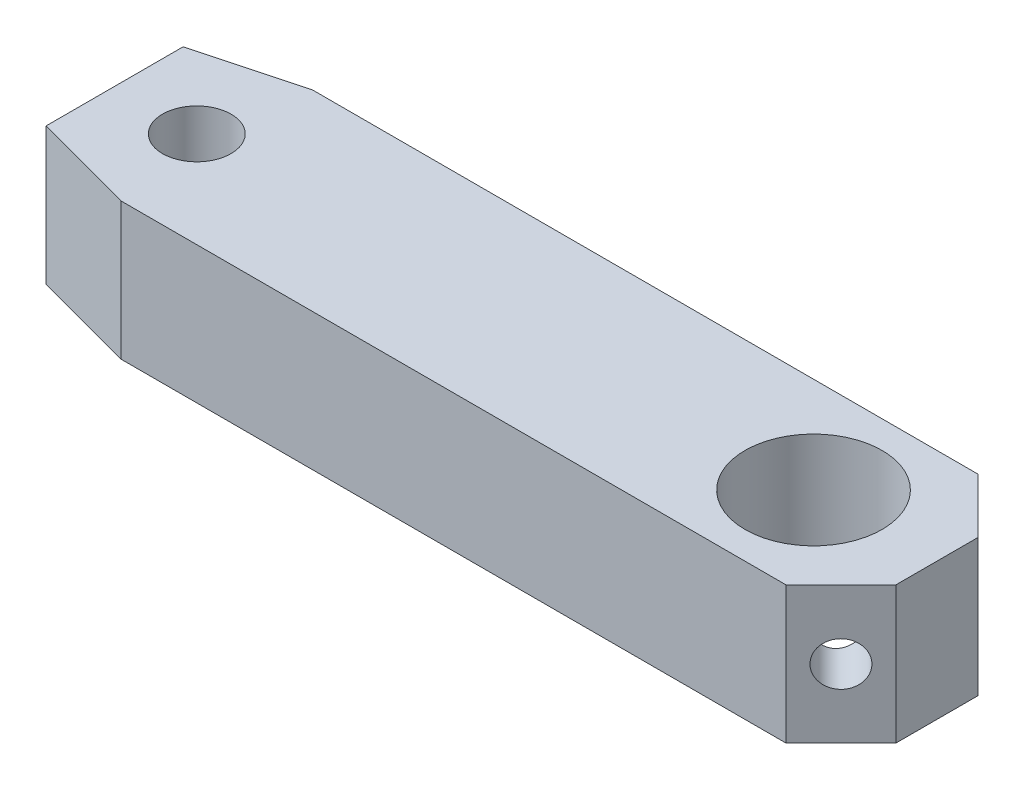
ISO-10303-21;
HEADER;
FILE_DESCRIPTION(('STEP AP214'),'2;1');
FILE_NAME('part.step','',(''),(''),'','','');
FILE_SCHEMA(('AUTOMOTIVE_DESIGN { 1 0 10303 214 1 1 1 1 }'));
ENDSEC;
DATA;
#1=APPLICATION_CONTEXT('core data for automotive mechanical design processes');
#2=APPLICATION_PROTOCOL_DEFINITION('international standard','automotive_design',2000,#1);
#3=PRODUCT_CONTEXT('',#1,'mechanical');
#4=PRODUCT('Part','Part','',(#3));
#5=PRODUCT_RELATED_PRODUCT_CATEGORY('part','',(#4));
#6=PRODUCT_DEFINITION_FORMATION('','',#4);
#7=PRODUCT_DEFINITION_CONTEXT('part definition',#1,'design');
#8=PRODUCT_DEFINITION('design','',#6,#7);
#9=PRODUCT_DEFINITION_SHAPE('','',#8);
#10=(LENGTH_UNIT() NAMED_UNIT(*) SI_UNIT(.MILLI.,.METRE.));
#11=(NAMED_UNIT(*) PLANE_ANGLE_UNIT() SI_UNIT($,.RADIAN.));
#12=(NAMED_UNIT(*) SI_UNIT($,.STERADIAN.) SOLID_ANGLE_UNIT());
#13=UNCERTAINTY_MEASURE_WITH_UNIT(LENGTH_MEASURE(1.E-05),#10,'distance_accuracy_value','');
#14=(GEOMETRIC_REPRESENTATION_CONTEXT(3) GLOBAL_UNCERTAINTY_ASSIGNED_CONTEXT((#13)) GLOBAL_UNIT_ASSIGNED_CONTEXT((#10,
#11,#12)) REPRESENTATION_CONTEXT('',''));
#15=CARTESIAN_POINT('',(0.,0.,0.));
#16=DIRECTION('',(0.,0.,1.));
#17=DIRECTION('',(1.,0.,0.));
#18=AXIS2_PLACEMENT_3D('',#15,#16,#17);
#19=CARTESIAN_POINT('',(0.,-5.,3.5));
#20=DIRECTION('',(0.,0.,1.));
#21=DIRECTION('',(1.,0.,0.));
#22=AXIS2_PLACEMENT_3D('',#19,#20,#21);
#23=PLANE('',#22);
#24=DIRECTION('',(1.,0.,0.));
#25=VECTOR('',#24,1.);
#26=CARTESIAN_POINT('',(0.,0.,3.5));
#27=LINE('',#26,#25);
#28=CARTESIAN_POINT('',(0.732050807568831,0.,3.5));
#29=VERTEX_POINT('',#28);
#30=CARTESIAN_POINT('',(25.,0.,3.5));
#31=VERTEX_POINT('',#30);
#32=EDGE_CURVE('E143',#29,#31,#27,.T.);
#33=ORIENTED_EDGE('',*,*,#32,.F.);
#34=DIRECTION('',(0.,1.,0.));
#35=VECTOR('',#34,1.);
#36=CARTESIAN_POINT('',(0.732050807568831,-5.,3.5));
#37=LINE('',#36,#35);
#38=CARTESIAN_POINT('',(0.732050807568831,-5.,3.5));
#39=VERTEX_POINT('',#38);
#40=EDGE_CURVE('E11',#39,#29,#37,.T.);
#41=ORIENTED_EDGE('',*,*,#40,.F.);
#42=DIRECTION('',(1.,0.,0.));
#43=VECTOR('',#42,1.);
#44=CARTESIAN_POINT('',(0.,-5.,3.5));
#45=LINE('',#44,#43);
#46=CARTESIAN_POINT('',(25.,-5.,3.5));
#47=VERTEX_POINT('',#46);
#48=EDGE_CURVE('E175',#39,#47,#45,.T.);
#49=ORIENTED_EDGE('',*,*,#48,.T.);
#50=DIRECTION('',(0.,1.,0.));
#51=VECTOR('',#50,1.);
#52=CARTESIAN_POINT('',(25.,-5.,3.5));
#53=LINE('',#52,#51);
#54=EDGE_CURVE('E46',#47,#31,#53,.T.);
#55=ORIENTED_EDGE('',*,*,#54,.T.);
#56=EDGE_LOOP('',(#33,#41,#49,#55));
#57=FACE_BOUND('',#56,.T.);
#58=ADVANCED_FACE('F42',(#57),#23,.T.);
#59=CARTESIAN_POINT('',(-0.825961894323354,-5.,3.08253175473055));
#60=DIRECTION('',(-0.258819045102524,0.,0.965925826289068));
#61=DIRECTION('',(0.965925826289068,0.,0.258819045102524));
#62=AXIS2_PLACEMENT_3D('',#59,#60,#61);
#63=PLANE('',#62);
#64=DIRECTION('',(0.965925826289068,0.,0.258819045102524));
#65=VECTOR('',#64,1.);
#66=CARTESIAN_POINT('',(-0.825961894323354,0.,3.08253175473055));
#67=LINE('',#66,#65);
#68=CARTESIAN_POINT('',(-3.,0.,2.5));
#69=VERTEX_POINT('',#68);
#70=EDGE_CURVE('E162',#69,#29,#67,.T.);
#71=ORIENTED_EDGE('',*,*,#70,.F.);
#72=DIRECTION('',(0.,1.,0.));
#73=VECTOR('',#72,1.);
#74=CARTESIAN_POINT('',(-3.,-5.,2.5));
#75=LINE('',#74,#73);
#76=CARTESIAN_POINT('',(-3.,-5.,2.5));
#77=VERTEX_POINT('',#76);
#78=EDGE_CURVE('E52',#77,#69,#75,.T.);
#79=ORIENTED_EDGE('',*,*,#78,.F.);
#80=DIRECTION('',(0.965925826289068,0.,0.258819045102524));
#81=VECTOR('',#80,1.);
#82=CARTESIAN_POINT('',(-0.825961894323354,-5.,3.08253175473055));
#83=LINE('',#82,#81);
#84=EDGE_CURVE('E129',#77,#39,#83,.T.);
#85=ORIENTED_EDGE('',*,*,#84,.T.);
#86=ORIENTED_EDGE('',*,*,#40,.T.);
#87=EDGE_LOOP('',(#71,#79,#85,#86));
#88=FACE_BOUND('',#87,.T.);
#89=ADVANCED_FACE('F179',(#88),#63,.T.);
#90=CARTESIAN_POINT('',(-3.,-5.,0.));
#91=DIRECTION('',(-1.,0.,0.));
#92=DIRECTION('',(0.,0.,1.));
#93=AXIS2_PLACEMENT_3D('',#90,#91,#92);
#94=PLANE('',#93);
#95=DIRECTION('',(0.,0.,1.));
#96=VECTOR('',#95,1.);
#97=CARTESIAN_POINT('',(-3.,0.,0.));
#98=LINE('',#97,#96);
#99=CARTESIAN_POINT('',(-3.,0.,-2.5));
#100=VERTEX_POINT('',#99);
#101=EDGE_CURVE('E117',#100,#69,#98,.T.);
#102=ORIENTED_EDGE('',*,*,#101,.F.);
#103=DIRECTION('',(0.,1.,0.));
#104=VECTOR('',#103,1.);
#105=CARTESIAN_POINT('',(-3.,-5.,-2.5));
#106=LINE('',#105,#104);
#107=CARTESIAN_POINT('',(-3.,-5.,-2.5));
#108=VERTEX_POINT('',#107);
#109=EDGE_CURVE('E112',#108,#100,#106,.T.);
#110=ORIENTED_EDGE('',*,*,#109,.F.);
#111=DIRECTION('',(0.,0.,1.));
#112=VECTOR('',#111,1.);
#113=CARTESIAN_POINT('',(-3.,-5.,0.));
#114=LINE('',#113,#112);
#115=EDGE_CURVE('E115',#108,#77,#114,.T.);
#116=ORIENTED_EDGE('',*,*,#115,.T.);
#117=ORIENTED_EDGE('',*,*,#78,.T.);
#118=EDGE_LOOP('',(#102,#110,#116,#117));
#119=FACE_BOUND('',#118,.T.);
#120=ADVANCED_FACE('F114',(#119),#94,.T.);
#121=CARTESIAN_POINT('',(-0.825961894323355,-5.,-3.08253175473055));
#122=DIRECTION('',(-0.258819045102524,0.,-0.965925826289068));
#123=DIRECTION('',(-0.965925826289068,0.,0.258819045102524));
#124=AXIS2_PLACEMENT_3D('',#121,#122,#123);
#125=PLANE('',#124);
#126=DIRECTION('',(-0.965925826289067,0.,0.258819045102524));
#127=VECTOR('',#126,1.);
#128=CARTESIAN_POINT('',(-0.825961894323355,0.,-3.08253175473055));
#129=LINE('',#128,#127);
#130=CARTESIAN_POINT('',(0.732050807568824,0.,-3.5));
#131=VERTEX_POINT('',#130);
#132=EDGE_CURVE('E159',#131,#100,#129,.T.);
#133=ORIENTED_EDGE('',*,*,#132,.F.);
#134=DIRECTION('',(0.,1.,0.));
#135=VECTOR('',#134,1.);
#136=CARTESIAN_POINT('',(0.732050807568824,-5.,-3.5));
#137=LINE('',#136,#135);
#138=CARTESIAN_POINT('',(0.732050807568824,-5.,-3.5));
#139=VERTEX_POINT('',#138);
#140=EDGE_CURVE('E122',#139,#131,#137,.T.);
#141=ORIENTED_EDGE('',*,*,#140,.F.);
#142=DIRECTION('',(-0.965925826289067,0.,0.258819045102524));
#143=VECTOR('',#142,1.);
#144=CARTESIAN_POINT('',(-0.825961894323355,-5.,-3.08253175473055));
#145=LINE('',#144,#143);
#146=EDGE_CURVE('E128',#139,#108,#145,.T.);
#147=ORIENTED_EDGE('',*,*,#146,.T.);
#148=ORIENTED_EDGE('',*,*,#109,.T.);
#149=EDGE_LOOP('',(#133,#141,#147,#148));
#150=FACE_BOUND('',#149,.T.);
#151=ADVANCED_FACE('F131',(#150),#125,.T.);
#152=CARTESIAN_POINT('',(0.,-5.,-3.5));
#153=DIRECTION('',(0.,0.,1.));
#154=DIRECTION('',(1.,0.,0.));
#155=AXIS2_PLACEMENT_3D('',#152,#153,#154);
#156=PLANE('',#155);
#157=DIRECTION('',(1.,0.,0.));
#158=VECTOR('',#157,1.);
#159=CARTESIAN_POINT('',(0.,0.,-3.5));
#160=LINE('',#159,#158);
#161=CARTESIAN_POINT('',(25.,0.,-3.5));
#162=VERTEX_POINT('',#161);
#163=EDGE_CURVE('E156',#131,#162,#160,.T.);
#164=ORIENTED_EDGE('',*,*,#163,.T.);
#165=DIRECTION('',(0.,1.,0.));
#166=VECTOR('',#165,1.);
#167=CARTESIAN_POINT('',(25.,-5.,-3.5));
#168=LINE('',#167,#166);
#169=CARTESIAN_POINT('',(25.,-5.,-3.5));
#170=VERTEX_POINT('',#169);
#171=EDGE_CURVE('E168',#170,#162,#168,.T.);
#172=ORIENTED_EDGE('',*,*,#171,.F.);
#173=DIRECTION('',(1.,0.,0.));
#174=VECTOR('',#173,1.);
#175=CARTESIAN_POINT('',(0.,-5.,-3.5));
#176=LINE('',#175,#174);
#177=EDGE_CURVE('E133',#139,#170,#176,.T.);
#178=ORIENTED_EDGE('',*,*,#177,.F.);
#179=ORIENTED_EDGE('',*,*,#140,.T.);
#180=EDGE_LOOP('',(#164,#172,#178,#179));
#181=FACE_BOUND('',#180,.T.);
#182=ADVANCED_FACE('F192',(#181),#156,.F.);
#183=CARTESIAN_POINT('',(14.25,-5.,-14.25));
#184=DIRECTION('',(-0.707106781186548,0.,0.707106781186547));
#185=DIRECTION('',(0.707106781186547,0.,0.707106781186548));
#186=AXIS2_PLACEMENT_3D('',#183,#184,#185);
#187=PLANE('',#186);
#188=CARTESIAN_POINT('',(26.,-2.5,-2.5));
#189=DIRECTION('',(0.707106781186549,0.,-0.707106781186546));
#190=DIRECTION('',(-0.707106781186546,0.,-0.707106781186549));
#191=AXIS2_PLACEMENT_3D('',#188,#189,#190);
#192=CIRCLE('',#191,0.799999999999998);
#193=CARTESIAN_POINT('',(25.4343145750508,-2.5,-3.06568542494924));
#194=VERTEX_POINT('',#193);
#195=EDGE_CURVE('E219',#194,#194,#192,.T.);
#196=ORIENTED_EDGE('',*,*,#195,.F.);
#197=EDGE_LOOP('',(#196));
#198=FACE_BOUND('',#197,.T.);
#199=DIRECTION('',(0.707106781186547,0.,0.707106781186548));
#200=VECTOR('',#199,1.);
#201=CARTESIAN_POINT('',(14.25,0.,-14.25));
#202=LINE('',#201,#200);
#203=CARTESIAN_POINT('',(27.,0.,-1.5));
#204=VERTEX_POINT('',#203);
#205=EDGE_CURVE('E153',#162,#204,#202,.T.);
#206=ORIENTED_EDGE('',*,*,#205,.T.);
#207=DIRECTION('',(0.,1.,0.));
#208=VECTOR('',#207,1.);
#209=CARTESIAN_POINT('',(27.,-5.,-1.5));
#210=LINE('',#209,#208);
#211=CARTESIAN_POINT('',(27.,-5.,-1.5));
#212=VERTEX_POINT('',#211);
#213=EDGE_CURVE('E171',#212,#204,#210,.T.);
#214=ORIENTED_EDGE('',*,*,#213,.F.);
#215=DIRECTION('',(0.707106781186547,0.,0.707106781186548));
#216=VECTOR('',#215,1.);
#217=CARTESIAN_POINT('',(14.25,-5.,-14.25));
#218=LINE('',#217,#216);
#219=EDGE_CURVE('E135',#170,#212,#218,.T.);
#220=ORIENTED_EDGE('',*,*,#219,.F.);
#221=ORIENTED_EDGE('',*,*,#171,.T.);
#222=EDGE_LOOP('',(#206,#214,#220,#221));
#223=FACE_BOUND('',#222,.T.);
#224=ADVANCED_FACE('F195',(#198,#223),#187,.F.);
#225=CARTESIAN_POINT('',(27.,-5.,0.));
#226=DIRECTION('',(-1.,0.,0.));
#227=DIRECTION('',(0.,0.,1.));
#228=AXIS2_PLACEMENT_3D('',#225,#226,#227);
#229=PLANE('',#228);
#230=DIRECTION('',(0.,0.,1.));
#231=VECTOR('',#230,1.);
#232=CARTESIAN_POINT('',(27.,0.,0.));
#233=LINE('',#232,#231);
#234=CARTESIAN_POINT('',(27.,0.,1.50000000000001));
#235=VERTEX_POINT('',#234);
#236=EDGE_CURVE('E150',#204,#235,#233,.T.);
#237=ORIENTED_EDGE('',*,*,#236,.T.);
#238=DIRECTION('',(0.,1.,0.));
#239=VECTOR('',#238,1.);
#240=CARTESIAN_POINT('',(27.,-5.,1.50000000000001));
#241=LINE('',#240,#239);
#242=CARTESIAN_POINT('',(27.,-5.,1.50000000000001));
#243=VERTEX_POINT('',#242);
#244=EDGE_CURVE('E173',#243,#235,#241,.T.);
#245=ORIENTED_EDGE('',*,*,#244,.F.);
#246=DIRECTION('',(0.,0.,1.));
#247=VECTOR('',#246,1.);
#248=CARTESIAN_POINT('',(27.,-5.,0.));
#249=LINE('',#248,#247);
#250=EDGE_CURVE('E274',#212,#243,#249,.T.);
#251=ORIENTED_EDGE('',*,*,#250,.F.);
#252=ORIENTED_EDGE('',*,*,#213,.T.);
#253=EDGE_LOOP('',(#237,#245,#251,#252));
#254=FACE_BOUND('',#253,.T.);
#255=ADVANCED_FACE('F199',(#254),#229,.F.);
#256=CARTESIAN_POINT('',(22.5,-5.,0.));
#257=DIRECTION('',(0.,1.,0.));
#258=DIRECTION('',(0.,0.,1.));
#259=AXIS2_PLACEMENT_3D('',#256,#257,#258);
#260=CYLINDRICAL_SURFACE('',#259,2.5);
#261=CARTESIAN_POINT('',(24.9761160595608,-2.5,0.344745209662324));
#262=CARTESIAN_POINT('',(24.9761161132327,-2.46056674168062,0.344744698496383));
#263=CARTESIAN_POINT('',(24.9756162079772,-2.42113468961461,0.348394094869442));
#264=CARTESIAN_POINT('',(24.9735673575216,-2.34357139868132,0.362648823498979));
#265=CARTESIAN_POINT('',(24.9720176498563,-2.30544112644636,0.373259211304448));
#266=CARTESIAN_POINT('',(24.9677505868392,-2.2317591660052,0.400491269083531));
#267=CARTESIAN_POINT('',(24.9650402937825,-2.19619337787686,0.417076486184014));
#268=CARTESIAN_POINT('',(24.9582779431126,-2.12801252759169,0.455240852150772));
#269=CARTESIAN_POINT('',(24.954225460699,-2.09539840379719,0.476821581434913));
#270=CARTESIAN_POINT('',(24.944087156873,-2.03029582870301,0.52644276801184));
#271=CARTESIAN_POINT('',(24.9378346664966,-1.99816762796562,0.554920009666209));
#272=CARTESIAN_POINT('',(24.9232087035849,-1.93826917730119,0.615659913443282));
#273=CARTESIAN_POINT('',(24.914834014564,-1.91050144171423,0.647924740970889));
#274=CARTESIAN_POINT('',(24.8940644901443,-1.85516103959588,0.721210602753545));
#275=CARTESIAN_POINT('',(24.8812227478646,-1.82847158901323,0.76277619707184));
#276=CARTESIAN_POINT('',(24.8520350256319,-1.78206825840768,0.848518577854122));
#277=CARTESIAN_POINT('',(24.8356873790795,-1.76235770779469,0.892696598926514));
#278=CARTESIAN_POINT('',(24.7986953460644,-1.72997450557127,0.984135869774383));
#279=CARTESIAN_POINT('',(24.7779063429172,-1.71761175489874,1.03144992309245));
#280=CARTESIAN_POINT('',(24.7327423537152,-1.70201456777326,1.12587442537223));
#281=CARTESIAN_POINT('',(24.7083698646201,-1.6987738065729,1.17298499278138));
#282=CARTESIAN_POINT('',(24.6589358209612,-1.70192578677669,1.26148814534927));
#283=CARTESIAN_POINT('',(24.6340967119677,-1.7075463773288,1.30303194308504));
#284=CARTESIAN_POINT('',(24.5830453640194,-1.72720966553188,1.38317592586862));
#285=CARTESIAN_POINT('',(24.5568338767105,-1.74124779607163,1.42177769438362));
#286=CARTESIAN_POINT('',(24.5065595247946,-1.77597710801097,1.49178495492437));
#287=CARTESIAN_POINT('',(24.4825013528259,-1.79600946708491,1.52352263174289));
#288=CARTESIAN_POINT('',(24.4354544195395,-1.84244032064919,1.58286153111332));
#289=CARTESIAN_POINT('',(24.412465555123,-1.86883819987569,1.61046315302071));
#290=CARTESIAN_POINT('',(24.3690812608835,-1.92672840221272,1.66060760856457));
#291=CARTESIAN_POINT('',(24.3486465635064,-1.9581203555707,1.68323263602939));
#292=CARTESIAN_POINT('',(24.3108775087112,-2.02546251293288,1.72380178799961));
#293=CARTESIAN_POINT('',(24.2935434025798,-2.06141308598629,1.74174553316549));
#294=CARTESIAN_POINT('',(24.2625316147044,-2.13761480075749,1.77312725582301));
#295=CARTESIAN_POINT('',(24.2489295329306,-2.17793458687524,1.78647330197107));
#296=CARTESIAN_POINT('',(24.2265263012616,-2.26117591642828,1.80813470822184));
#297=CARTESIAN_POINT('',(24.2177254043574,-2.30409759683393,1.81644980322894));
#298=CARTESIAN_POINT('',(24.2053166252262,-2.39186348402947,1.82810549207641));
#299=CARTESIAN_POINT('',(24.2017701510396,-2.43672421397746,1.83138727735636));
#300=CARTESIAN_POINT('',(24.2002593443137,-2.52662001615662,1.83279002684497));
#301=CARTESIAN_POINT('',(24.2022950756177,-2.57165509037588,1.83091093202898));
#302=CARTESIAN_POINT('',(24.2118368434312,-2.6606187377018,1.82199246655725));
#303=CARTESIAN_POINT('',(24.2193426077574,-2.70454736575156,1.81495335265862));
#304=CARTESIAN_POINT('',(24.2394187587553,-2.79005863081356,1.7957210735142));
#305=CARTESIAN_POINT('',(24.2519893736306,-2.83164116202303,1.78352767603408));
#306=CARTESIAN_POINT('',(24.2815378115837,-2.91130388691657,1.75401181197065));
#307=CARTESIAN_POINT('',(24.2985182817885,-2.94938195830203,1.736686263803));
#308=CARTESIAN_POINT('',(24.3359977542026,-3.02091139313654,1.69701337161271));
#309=CARTESIAN_POINT('',(24.356496518647,-3.05436306895999,1.67466636690667));
#310=CARTESIAN_POINT('',(24.3997715561237,-3.11539789199744,1.62540185576983));
#311=CARTESIAN_POINT('',(24.4225266418752,-3.14302920469224,1.59852546783562));
#312=CARTESIAN_POINT('',(24.4693252283709,-3.19199041793055,1.5405012959648));
#313=CARTESIAN_POINT('',(24.4933684573768,-3.21332164136421,1.50935441075957));
#314=CARTESIAN_POINT('',(24.5411107304113,-3.24877608075622,1.44411446660777));
#315=CARTESIAN_POINT('',(24.5648069449739,-3.26303590455338,1.41009343756235));
#316=CARTESIAN_POINT('',(24.6113453467195,-3.28474832348791,1.33940688742119));
#317=CARTESIAN_POINT('',(24.6341875325895,-3.29220090816009,1.30274136225999));
#318=CARTESIAN_POINT('',(24.6783579295829,-3.30037927287404,1.22746647973505));
#319=CARTESIAN_POINT('',(24.6996750466094,-3.30105992991869,1.18884580449425));
#320=CARTESIAN_POINT('',(24.7400598722893,-3.29587437805174,1.11088327763565));
#321=CARTESIAN_POINT('',(24.7591269679545,-3.29000638958123,1.07154123284769));
#322=CARTESIAN_POINT('',(24.7958540586701,-3.27157274732221,0.990534341936411));
#323=CARTESIAN_POINT('',(24.8133411589111,-3.25859520323939,0.948885363631738));
#324=CARTESIAN_POINT('',(24.8452896134877,-3.22627012291633,0.866922811663172));
#325=CARTESIAN_POINT('',(24.8597496768774,-3.20691987791406,0.826609813901095));
#326=CARTESIAN_POINT('',(24.8869699033778,-3.16022806752809,0.744589867127315));
#327=CARTESIAN_POINT('',(24.8994352525473,-3.13229923878663,0.703118300343519));
#328=CARTESIAN_POINT('',(24.9211250594103,-3.06992905260776,0.62435987055659));
#329=CARTESIAN_POINT('',(24.9303460650659,-3.03548081796418,0.587077493450344));
#330=CARTESIAN_POINT('',(24.946148957795,-2.95946649822726,0.517366838792101));
#331=CARTESIAN_POINT('',(24.9526461342799,-2.91772228773495,0.485111616216579));
#332=CARTESIAN_POINT('',(24.9630645359495,-2.82860677724593,0.429103117075196));
#333=CARTESIAN_POINT('',(24.9669921031293,-2.78124967448793,0.405328975066385));
#334=CARTESIAN_POINT('',(24.9720075866687,-2.69479840098415,0.373325606776821));
#335=CARTESIAN_POINT('',(24.9735611750963,-2.6566202388869,0.362690903771168));
#336=CARTESIAN_POINT('',(24.9756148222796,-2.57896002287273,0.348404688671673));
#337=CARTESIAN_POINT('',(24.9761160058261,-2.53947940689718,0.34474572142648));
#338=CARTESIAN_POINT('',(24.9761160595608,-2.5,0.344745209662324));
#339=B_SPLINE_CURVE_WITH_KNOTS('',3,(#261,#262,#263,#264,#265,#266,#267,#268,#269,#270,#271,
#272,#273,#274,#275,#276,#277,#278,#279,#280,#281,#282,#283,#284,#285,#286,#287,#288,#289,#290,
#291,#292,#293,#294,#295,#296,#297,#298,#299,#300,#301,#302,#303,#304,#305,#306,#307,#308,#309,
#310,#311,#312,#313,#314,#315,#316,#317,#318,#319,#320,#321,#322,#323,#324,#325,#326,#327,#328,
#329,#330,#331,#332,#333,#334,#335,#336,#337,#338),.UNSPECIFIED.,.T.,.F.,(4,2,2,2,2,2,2,2,2,2,2,
2,2,2,2,2,2,2,2,2,2,2,2,2,2,2,2,2,2,2,2,2,2,2,2,2,2,2,4),(0.,0.118135025892344,0.23635594465771,
0.3538674761644,0.471416235437724,0.601094876622618,0.730848020943202,0.88329083936668,
1.03580628570236,1.19436650179407,1.352816752769,1.49820453472615,1.64351350480901,
1.7766018016111,1.9096772398227,2.04035474791816,2.1710428419499,2.30421008102518,
2.43738433646307,2.57210303873622,2.70682328178433,2.84153682174975,2.97625643209217,
3.11105709895636,3.24584865962665,3.37947667728373,3.51307661580309,3.64398393798155,
3.77489146141141,3.90667067388502,4.03848570536667,4.1788983558552,4.31937076694053,
4.47327698869665,4.62734647760568,4.78590442380196,4.94406954545265,5.06246943242024,
5.18074271124086),.UNSPECIFIED.);
#340=CARTESIAN_POINT('',(24.9761160595608,-2.5,0.344745209662324));
#341=VERTEX_POINT('',#340);
#342=EDGE_CURVE('E216',#341,#341,#339,.T.);
#343=ORIENTED_EDGE('',*,*,#342,.T.);
#344=EDGE_LOOP('',(#343));
#345=FACE_BOUND('',#344,.T.);
#346=CARTESIAN_POINT('',(24.2008607603936,-2.5,-1.83223161029205));
#347=CARTESIAN_POINT('',(24.2008648801786,-2.45511326993816,-1.83223013177822));
#348=CARTESIAN_POINT('',(24.2036492340224,-2.41017010637644,-1.82965547674311));
#349=CARTESIAN_POINT('',(24.2146576573886,-2.3214808782315,-1.81934136918294));
#350=CARTESIAN_POINT('',(24.2228946791907,-2.27773792291847,-1.81158961858245));
#351=CARTESIAN_POINT('',(24.2443612764904,-2.19280202534328,-1.79092840906667));
#352=CARTESIAN_POINT('',(24.2575864953788,-2.15160689429282,-1.77802345030279));
#353=CARTESIAN_POINT('',(24.2883236751216,-2.07292539213671,-1.74710364885491));
#354=CARTESIAN_POINT('',(24.305833403646,-2.03543710391496,-1.7290914663809));
#355=CARTESIAN_POINT('',(24.344190032862,-1.96530086302158,-1.68811922765493));
#356=CARTESIAN_POINT('',(24.3650292861095,-1.93264214078916,-1.66517046915432));
#357=CARTESIAN_POINT('',(24.4090093534833,-1.87301872593437,-1.61456006111984));
#358=CARTESIAN_POINT('',(24.4321499808939,-1.84605357193322,-1.58689879379302));
#359=CARTESIAN_POINT('',(24.4791510139826,-1.79901293698696,-1.52786043565167));
#360=CARTESIAN_POINT('',(24.502991331958,-1.7788235796518,-1.49655807941051));
#361=CARTESIAN_POINT('',(24.5506691383271,-1.74518073120719,-1.4305286623032));
#362=CARTESIAN_POINT('',(24.5745066266546,-1.73172630619959,-1.39580207705693));
#363=CARTESIAN_POINT('',(24.6209282501723,-1.71186018287937,-1.32418439651625));
#364=CARTESIAN_POINT('',(24.6435232285704,-1.70537319043,-1.28732107520673));
#365=CARTESIAN_POINT('',(24.6869727048775,-1.69908855866192,-1.21203983727546));
#366=CARTESIAN_POINT('',(24.7078268939374,-1.69929210385354,-1.17362164657806));
#367=CARTESIAN_POINT('',(24.7480459610206,-1.70621376606516,-1.09468168764496));
#368=CARTESIAN_POINT('',(24.7673201026064,-1.71318758604026,-1.05413658457001));
#369=CARTESIAN_POINT('',(24.8031164038862,-1.73353930363846,-0.973450686583876));
#370=CARTESIAN_POINT('',(24.8196377096941,-1.74691918335304,-0.933310020736693));
#371=CARTESIAN_POINT('',(24.851218435216,-1.78105088773705,-0.850819246267594));
#372=CARTESIAN_POINT('',(24.866010792575,-1.80235967468314,-0.808597318678108));
#373=CARTESIAN_POINT('',(24.8923661095766,-1.85141542163875,-0.726931666897512));
#374=CARTESIAN_POINT('',(24.9039257403612,-1.87916896463429,-0.687490837522649));
#375=CARTESIAN_POINT('',(24.9248212789169,-1.9429183872633,-0.609895090498119));
#376=CARTESIAN_POINT('',(24.9339282181332,-1.97937338736102,-0.572053323883855));
#377=CARTESIAN_POINT('',(24.9491383035971,-2.05860878028165,-0.502963580261829));
#378=CARTESIAN_POINT('',(24.9552457263458,-2.10138005389413,-0.471706252171193));
#379=CARTESIAN_POINT('',(24.9637091858988,-2.18081128697242,-0.424914469586835));
#380=CARTESIAN_POINT('',(24.9666246930427,-2.21624837797794,-0.407403190801535));
#381=CARTESIAN_POINT('',(24.9712465711975,-2.28956508365164,-0.378362279625305));
#382=CARTESIAN_POINT('',(24.9729543208457,-2.32744185937122,-0.366825831095245));
#383=CARTESIAN_POINT('',(24.9753109152024,-2.40491418875762,-0.350580042074792));
#384=CARTESIAN_POINT('',(24.975953686316,-2.4445182877695,-0.345909877038357));
#385=CARTESIAN_POINT('',(24.9762245885395,-2.5239132547197,-0.343967165538638));
#386=CARTESIAN_POINT('',(24.9758528529292,-2.56370409743918,-0.346693647348538));
#387=CARTESIAN_POINT('',(24.9741376391166,-2.6386023965984,-0.358710539917134));
#388=CARTESIAN_POINT('',(24.9728833773903,-2.67381198221758,-0.367396612073287));
#389=CARTESIAN_POINT('',(24.9694091796629,-2.74242277304338,-0.39006248261614));
#390=CARTESIAN_POINT('',(24.9671889416174,-2.77582340894561,-0.404043936602456));
#391=CARTESIAN_POINT('',(24.961444200296,-2.84264883188784,-0.437726005240804));
#392=CARTESIAN_POINT('',(24.9578346102091,-2.87588880270857,-0.457776000067309));
#393=CARTESIAN_POINT('',(24.9491634610648,-2.93919765208647,-0.502104163610404));
#394=CARTESIAN_POINT('',(24.9441011543758,-2.96926488688937,-0.526384506915263));
#395=CARTESIAN_POINT('',(24.9312435584999,-3.03122437982066,-0.583136795212581));
#396=CARTESIAN_POINT('',(24.923115620392,-3.06242191125903,-0.616292907533007));
#397=CARTESIAN_POINT('',(24.9042672985901,-3.11964776512251,-0.686156384488577));
#398=CARTESIAN_POINT('',(24.8935449115297,-3.14567206448692,-0.722866480212853));
#399=CARTESIAN_POINT('',(24.8676235106032,-3.19532578881442,-0.803994269220446));
#400=CARTESIAN_POINT('',(24.8520135920066,-3.21814570149869,-0.848780611426044));
#401=CARTESIAN_POINT('',(24.8169925229,-3.25588292994662,-0.940180511458005));
#402=CARTESIAN_POINT('',(24.7975812721835,-3.27080003734693,-0.98679411742674));
#403=CARTESIAN_POINT('',(24.7553335298791,-3.29181468885276,-1.07983772898438));
#404=CARTESIAN_POINT('',(24.7325375350825,-3.29800847915875,-1.12626401050084));
#405=CARTESIAN_POINT('',(24.6839317913552,-3.30117295373525,-1.21783468598897));
#406=CARTESIAN_POINT('',(24.6581244372571,-3.29815091960803,-1.26298006357406));
#407=CARTESIAN_POINT('',(24.6071550056671,-3.28327769277295,-1.34612222116404));
#408=CARTESIAN_POINT('',(24.5821724661955,-3.27230986851106,-1.38438789660125));
#409=CARTESIAN_POINT('',(24.5317135553484,-3.24263433811765,-1.45743226028967));
#410=CARTESIAN_POINT('',(24.506237355381,-3.22392927417601,-1.4922121338753));
#411=CARTESIAN_POINT('',(24.4576777322708,-3.18067307073394,-1.55530871924514));
#412=CARTESIAN_POINT('',(24.4345451586745,-3.15656920815094,-1.58389575662615));
#413=CARTESIAN_POINT('',(24.3900672257984,-3.10263406036474,-1.6367160036897));
#414=CARTESIAN_POINT('',(24.3687216579888,-3.07280344477065,-1.66094972174994));
#415=CARTESIAN_POINT('',(24.3288451891552,-3.0082378586125,-1.70475962578709));
#416=CARTESIAN_POINT('',(24.31031492529,-2.97350178126766,-1.72433475800017));
#417=CARTESIAN_POINT('',(24.2769725375385,-2.90006293276065,-1.7586766777635));
#418=CARTESIAN_POINT('',(24.262162719201,-2.86135772275489,-1.77344048542657));
#419=CARTESIAN_POINT('',(24.2367524582592,-2.78022024059018,-1.79833677087483));
#420=CARTESIAN_POINT('',(24.226245670174,-2.73772732618305,-1.80836686420059));
#421=CARTESIAN_POINT('',(24.2104690804277,-2.65098389913886,-1.82329827838739));
#422=CARTESIAN_POINT('',(24.2051872336506,-2.60673767470964,-1.82821139685747));
#423=CARTESIAN_POINT('',(24.2014526137029,-2.54154155358653,-1.83168167406895));
#424=CARTESIAN_POINT('',(24.2008588534593,-2.52077682225255,-1.83223229465509));
#425=CARTESIAN_POINT('',(24.2008607603936,-2.5,-1.83223161029205));
#426=B_SPLINE_CURVE_WITH_KNOTS('',3,(#346,#347,#348,#349,#350,#351,#352,#353,#354,#355,#356,
#357,#358,#359,#360,#361,#362,#363,#364,#365,#366,#367,#368,#369,#370,#371,#372,#373,#374,#375,
#376,#377,#378,#379,#380,#381,#382,#383,#384,#385,#386,#387,#388,#389,#390,#391,#392,#393,#394,
#395,#396,#397,#398,#399,#400,#401,#402,#403,#404,#405,#406,#407,#408,#409,#410,#411,#412,#413,
#414,#415,#416,#417,#418,#419,#420,#421,#422,#423,#424,#425),.UNSPECIFIED.,.T.,.F.,(4,2,2,2,2,2,
2,2,2,2,2,2,2,2,2,2,2,2,2,2,2,2,2,2,2,2,2,2,2,2,2,2,2,2,2,2,2,2,2,4),(0.,0.134599409485381,
0.269519699552381,0.404322424300459,0.539055062660273,0.67348257416962,0.807899188149992,
0.939928085367228,1.07193866974678,1.20250785594717,1.33310015858307,1.46882463131713,
1.6045911255676,1.75262764830749,1.9008160530861,2.06001226609788,2.21898084456925,
2.33741191413473,2.45570757722451,2.57467558957834,2.69362797338969,2.80201802342096,
2.9104419895823,3.0269705026879,3.143559094349,3.2817579601255,3.42006388196669,
3.57721535492891,3.73437097110047,3.88977869793473,4.04506366592229,4.18531063742705,
4.3255097554821,4.45679552881983,4.58806596071297,4.7193660575817,4.85074732111206,
4.98485293248066,5.11864866314968,5.18095099620719),.UNSPECIFIED.);
#427=CARTESIAN_POINT('',(24.2008607603936,-2.5,-1.83223161029205));
#428=VERTEX_POINT('',#427);
#429=EDGE_CURVE('E245',#428,#428,#426,.T.);
#430=ORIENTED_EDGE('',*,*,#429,.T.);
#431=EDGE_LOOP('',(#430));
#432=FACE_BOUND('',#431,.T.);
#433=CARTESIAN_POINT('',(22.5,-5.,0.));
#434=DIRECTION('',(0.,1.,0.));
#435=DIRECTION('',(0.,0.,1.));
#436=AXIS2_PLACEMENT_3D('',#433,#434,#435);
#437=CIRCLE('',#436,2.5);
#438=CARTESIAN_POINT('',(22.5,-5.,2.5));
#439=VERTEX_POINT('',#438);
#440=EDGE_CURVE('E164',#439,#439,#437,.T.);
#441=ORIENTED_EDGE('',*,*,#440,.F.);
#442=EDGE_LOOP('',(#441));
#443=FACE_BOUND('',#442,.T.);
#444=CARTESIAN_POINT('',(22.5,0.,0.));
#445=DIRECTION('',(0.,1.,0.));
#446=DIRECTION('',(0.,0.,1.));
#447=AXIS2_PLACEMENT_3D('',#444,#445,#446);
#448=CIRCLE('',#447,2.5);
#449=CARTESIAN_POINT('',(22.5,0.,2.5));
#450=VERTEX_POINT('',#449);
#451=EDGE_CURVE('E140',#450,#450,#448,.T.);
#452=ORIENTED_EDGE('',*,*,#451,.T.);
#453=EDGE_LOOP('',(#452));
#454=FACE_BOUND('',#453,.T.);
#455=ADVANCED_FACE('F44',(#345,#432,#443,#454),#260,.F.);
#456=CARTESIAN_POINT('',(14.25,-5.,14.25));
#457=DIRECTION('',(0.707106781186546,0.,0.707106781186549));
#458=DIRECTION('',(0.707106781186549,0.,-0.707106781186546));
#459=AXIS2_PLACEMENT_3D('',#456,#457,#458);
#460=PLANE('',#459);
#461=CARTESIAN_POINT('',(26.,-2.5,2.5));
#462=DIRECTION('',(0.707106781186549,0.,0.707106781186546));
#463=DIRECTION('',(0.707106781186546,0.,-0.707106781186549));
#464=AXIS2_PLACEMENT_3D('',#461,#462,#463);
#465=CIRCLE('',#464,0.799999999999998);
#466=CARTESIAN_POINT('',(26.5656854249492,-2.5,1.93431457505076));
#467=VERTEX_POINT('',#466);
#468=EDGE_CURVE('E214',#467,#467,#465,.T.);
#469=ORIENTED_EDGE('',*,*,#468,.F.);
#470=EDGE_LOOP('',(#469));
#471=FACE_BOUND('',#470,.T.);
#472=DIRECTION('',(0.707106781186549,0.,-0.707106781186546));
#473=VECTOR('',#472,1.);
#474=CARTESIAN_POINT('',(14.25,0.,14.25));
#475=LINE('',#474,#473);
#476=EDGE_CURVE('E147',#31,#235,#475,.T.);
#477=ORIENTED_EDGE('',*,*,#476,.F.);
#478=ORIENTED_EDGE('',*,*,#54,.F.);
#479=DIRECTION('',(0.707106781186549,0.,-0.707106781186546));
#480=VECTOR('',#479,1.);
#481=CARTESIAN_POINT('',(14.25,-5.,14.25));
#482=LINE('',#481,#480);
#483=EDGE_CURVE('E272',#47,#243,#482,.T.);
#484=ORIENTED_EDGE('',*,*,#483,.T.);
#485=ORIENTED_EDGE('',*,*,#244,.T.);
#486=EDGE_LOOP('',(#477,#478,#484,#485));
#487=FACE_BOUND('',#486,.T.);
#488=ADVANCED_FACE('F176',(#471,#487),#460,.T.);
#489=CARTESIAN_POINT('',(0.,-5.,0.));
#490=DIRECTION('',(0.,1.,0.));
#491=DIRECTION('',(0.,0.,1.));
#492=AXIS2_PLACEMENT_3D('',#489,#490,#491);
#493=PLANE('',#492);
#494=CARTESIAN_POINT('',(0.,-5.,0.));
#495=DIRECTION('',(0.,1.,0.));
#496=DIRECTION('',(0.,0.,1.));
#497=AXIS2_PLACEMENT_3D('',#494,#495,#496);
#498=CIRCLE('',#497,1.25);
#499=CARTESIAN_POINT('',(0.,-5.,1.25));
#500=VERTEX_POINT('',#499);
#501=EDGE_CURVE('E144',#500,#500,#498,.T.);
#502=ORIENTED_EDGE('',*,*,#501,.T.);
#503=EDGE_LOOP('',(#502));
#504=FACE_BOUND('',#503,.T.);
#505=ORIENTED_EDGE('',*,*,#440,.T.);
#506=EDGE_LOOP('',(#505));
#507=FACE_BOUND('',#506,.T.);
#508=ORIENTED_EDGE('',*,*,#48,.F.);
#509=ORIENTED_EDGE('',*,*,#84,.F.);
#510=ORIENTED_EDGE('',*,*,#115,.F.);
#511=ORIENTED_EDGE('',*,*,#146,.F.);
#512=ORIENTED_EDGE('',*,*,#177,.T.);
#513=ORIENTED_EDGE('',*,*,#219,.T.);
#514=ORIENTED_EDGE('',*,*,#250,.T.);
#515=ORIENTED_EDGE('',*,*,#483,.F.);
#516=EDGE_LOOP('',(#508,#509,#510,#511,#512,#513,#514,#515));
#517=FACE_BOUND('',#516,.T.);
#518=ADVANCED_FACE('F126',(#504,#507,#517),#493,.F.);
#519=CARTESIAN_POINT('',(0.,0.,0.));
#520=DIRECTION('',(0.,1.,0.));
#521=DIRECTION('',(0.,0.,1.));
#522=AXIS2_PLACEMENT_3D('',#519,#520,#521);
#523=PLANE('',#522);
#524=CARTESIAN_POINT('',(0.,0.,0.));
#525=DIRECTION('',(0.,1.,0.));
#526=DIRECTION('',(0.,0.,1.));
#527=AXIS2_PLACEMENT_3D('',#524,#525,#526);
#528=CIRCLE('',#527,1.25);
#529=CARTESIAN_POINT('',(0.,0.,1.25));
#530=VERTEX_POINT('',#529);
#531=EDGE_CURVE('E260',#530,#530,#528,.T.);
#532=ORIENTED_EDGE('',*,*,#531,.F.);
#533=EDGE_LOOP('',(#532));
#534=FACE_BOUND('',#533,.T.);
#535=ORIENTED_EDGE('',*,*,#451,.F.);
#536=EDGE_LOOP('',(#535));
#537=FACE_BOUND('',#536,.T.);
#538=ORIENTED_EDGE('',*,*,#32,.T.);
#539=ORIENTED_EDGE('',*,*,#476,.T.);
#540=ORIENTED_EDGE('',*,*,#236,.F.);
#541=ORIENTED_EDGE('',*,*,#205,.F.);
#542=ORIENTED_EDGE('',*,*,#163,.F.);
#543=ORIENTED_EDGE('',*,*,#132,.T.);
#544=ORIENTED_EDGE('',*,*,#101,.T.);
#545=ORIENTED_EDGE('',*,*,#70,.T.);
#546=EDGE_LOOP('',(#538,#539,#540,#541,#542,#543,#544,#545));
#547=FACE_BOUND('',#546,.T.);
#548=ADVANCED_FACE('F178',(#534,#537,#547),#523,.T.);
#549=CARTESIAN_POINT('',(0.,0.,0.));
#550=DIRECTION('',(0.,1.,0.));
#551=DIRECTION('',(0.,0.,1.));
#552=AXIS2_PLACEMENT_3D('',#549,#550,#551);
#553=CYLINDRICAL_SURFACE('',#552,1.25);
#554=ORIENTED_EDGE('',*,*,#501,.F.);
#555=EDGE_LOOP('',(#554));
#556=FACE_BOUND('',#555,.T.);
#557=ORIENTED_EDGE('',*,*,#531,.T.);
#558=EDGE_LOOP('',(#557));
#559=FACE_BOUND('',#558,.T.);
#560=ADVANCED_FACE('F238',(#556,#559),#553,.F.);
#561=CARTESIAN_POINT('',(26.,-2.5,-2.5));
#562=DIRECTION('',(0.707106781186549,0.,-0.707106781186546));
#563=DIRECTION('',(-0.707106781186546,0.,-0.707106781186549));
#564=AXIS2_PLACEMENT_3D('',#561,#562,#563);
#565=CYLINDRICAL_SURFACE('',#564,0.799999999999998);
#566=ORIENTED_EDGE('',*,*,#429,.F.);
#567=EDGE_LOOP('',(#566));
#568=FACE_BOUND('',#567,.T.);
#569=ORIENTED_EDGE('',*,*,#195,.T.);
#570=EDGE_LOOP('',(#569));
#571=FACE_BOUND('',#570,.T.);
#572=ADVANCED_FACE('F233',(#568,#571),#565,.F.);
#573=CARTESIAN_POINT('',(26.,-2.5,2.5));
#574=DIRECTION('',(0.707106781186549,0.,0.707106781186546));
#575=DIRECTION('',(0.707106781186546,0.,-0.707106781186549));
#576=AXIS2_PLACEMENT_3D('',#573,#574,#575);
#577=CYLINDRICAL_SURFACE('',#576,0.799999999999998);
#578=ORIENTED_EDGE('',*,*,#342,.F.);
#579=EDGE_LOOP('',(#578));
#580=FACE_BOUND('',#579,.T.);
#581=ORIENTED_EDGE('',*,*,#468,.T.);
#582=EDGE_LOOP('',(#581));
#583=FACE_BOUND('',#582,.T.);
#584=ADVANCED_FACE('F230',(#580,#583),#577,.F.);
#585=CLOSED_SHELL('',(#58,#89,#120,#151,#182,#224,#255,#455,#488,#518,#548,#560,#572,#584));
#586=MANIFOLD_SOLID_BREP('B2',#585);
#587=ADVANCED_BREP_SHAPE_REPRESENTATION('',(#18,#586),#14);
#588=SHAPE_DEFINITION_REPRESENTATION(#9,#587);
ENDSEC;
END-ISO-10303-21;
